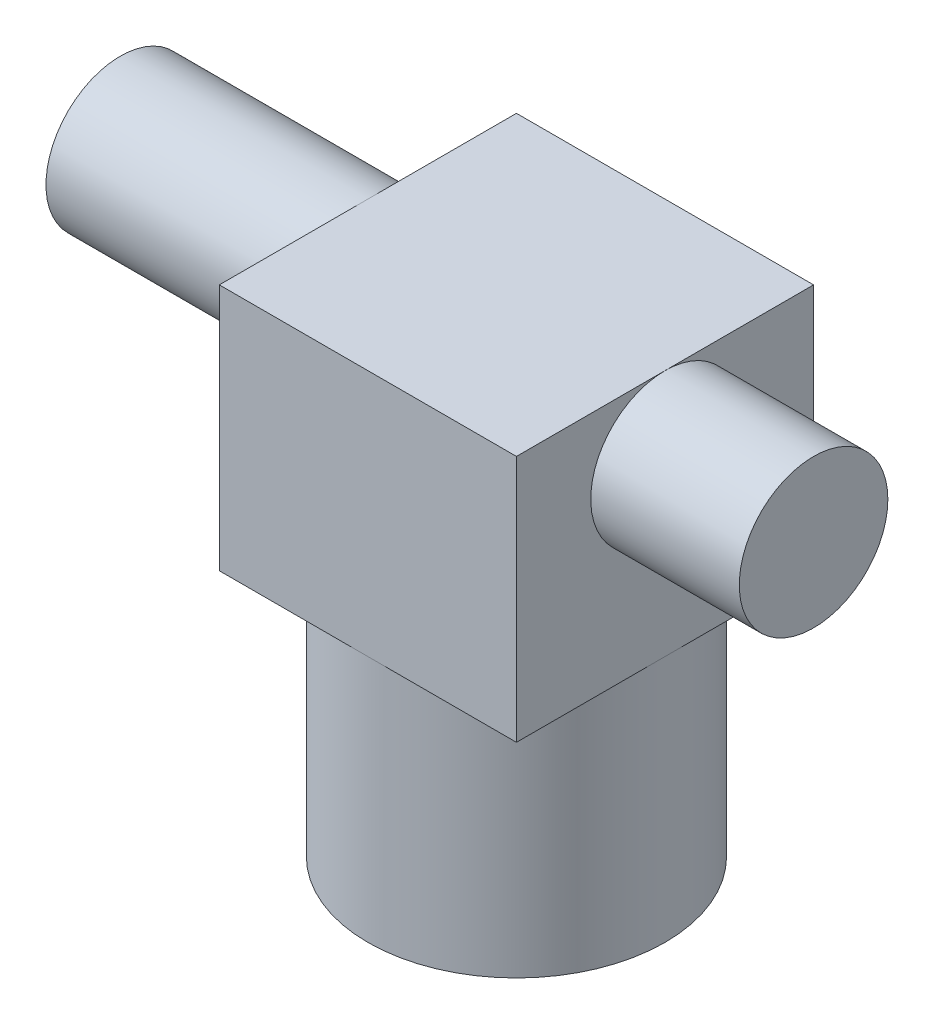
ISO-10303-21;
HEADER;
FILE_DESCRIPTION(('STEP AP214'),'2;1');
FILE_NAME('part.step','',(''),(''),'','','');
FILE_SCHEMA(('AUTOMOTIVE_DESIGN { 1 0 10303 214 1 1 1 1 }'));
ENDSEC;
DATA;
#1=APPLICATION_CONTEXT('core data for automotive mechanical design processes');
#2=APPLICATION_PROTOCOL_DEFINITION('international standard','automotive_design',2000,#1);
#3=PRODUCT_CONTEXT('',#1,'mechanical');
#4=PRODUCT('Part','Part','',(#3));
#5=PRODUCT_RELATED_PRODUCT_CATEGORY('part','',(#4));
#6=PRODUCT_DEFINITION_FORMATION('','',#4);
#7=PRODUCT_DEFINITION_CONTEXT('part definition',#1,'design');
#8=PRODUCT_DEFINITION('design','',#6,#7);
#9=PRODUCT_DEFINITION_SHAPE('','',#8);
#10=(LENGTH_UNIT() NAMED_UNIT(*) SI_UNIT(.MILLI.,.METRE.));
#11=(NAMED_UNIT(*) PLANE_ANGLE_UNIT() SI_UNIT($,.RADIAN.));
#12=(NAMED_UNIT(*) SI_UNIT($,.STERADIAN.) SOLID_ANGLE_UNIT());
#13=UNCERTAINTY_MEASURE_WITH_UNIT(LENGTH_MEASURE(1.E-05),#10,'distance_accuracy_value','');
#14=(GEOMETRIC_REPRESENTATION_CONTEXT(3) GLOBAL_UNCERTAINTY_ASSIGNED_CONTEXT((#13)) GLOBAL_UNIT_ASSIGNED_CONTEXT((#10,
#11,#12)) REPRESENTATION_CONTEXT('',''));
#15=CARTESIAN_POINT('',(0.,0.,0.));
#16=DIRECTION('',(0.,0.,1.));
#17=DIRECTION('',(1.,0.,0.));
#18=AXIS2_PLACEMENT_3D('',#15,#16,#17);
#19=CARTESIAN_POINT('',(0.,-31.75,0.));
#20=DIRECTION('',(0.,1.,0.));
#21=DIRECTION('',(0.,0.,1.));
#22=AXIS2_PLACEMENT_3D('',#19,#20,#21);
#23=CYLINDRICAL_SURFACE('',#22,19.05);
#24=CARTESIAN_POINT('',(0.,0.,0.));
#25=DIRECTION('',(0.,-1.,0.));
#26=DIRECTION('',(0.,0.,1.));
#27=AXIS2_PLACEMENT_3D('',#24,#25,#26);
#28=CIRCLE('',#27,19.05);
#29=CARTESIAN_POINT('',(19.05,0.,0.));
#30=VERTEX_POINT('',#29);
#31=CARTESIAN_POINT('',(0.,0.,19.05));
#32=VERTEX_POINT('',#31);
#33=EDGE_CURVE('E104',#30,#32,#28,.T.);
#34=ORIENTED_EDGE('',*,*,#33,.T.);
#35=CARTESIAN_POINT('',(0.,0.,0.));
#36=DIRECTION('',(0.,-1.,0.));
#37=DIRECTION('',(0.,0.,1.));
#38=AXIS2_PLACEMENT_3D('',#35,#36,#37);
#39=CIRCLE('',#38,19.05);
#40=CARTESIAN_POINT('',(-19.05,0.,0.));
#41=VERTEX_POINT('',#40);
#42=EDGE_CURVE('E157',#32,#41,#39,.T.);
#43=ORIENTED_EDGE('',*,*,#42,.T.);
#44=CARTESIAN_POINT('',(0.,0.,0.));
#45=DIRECTION('',(0.,-1.,0.));
#46=DIRECTION('',(0.,0.,1.));
#47=AXIS2_PLACEMENT_3D('',#44,#45,#46);
#48=CIRCLE('',#47,19.05);
#49=CARTESIAN_POINT('',(0.,0.,-19.05));
#50=VERTEX_POINT('',#49);
#51=EDGE_CURVE('E119',#41,#50,#48,.T.);
#52=ORIENTED_EDGE('',*,*,#51,.T.);
#53=CARTESIAN_POINT('',(0.,0.,0.));
#54=DIRECTION('',(0.,-1.,0.));
#55=DIRECTION('',(0.,0.,1.));
#56=AXIS2_PLACEMENT_3D('',#53,#54,#55);
#57=CIRCLE('',#56,19.05);
#58=EDGE_CURVE('E26',#50,#30,#57,.T.);
#59=ORIENTED_EDGE('',*,*,#58,.T.);
#60=EDGE_LOOP('',(#34,#43,#52,#59));
#61=FACE_BOUND('',#60,.T.);
#62=CARTESIAN_POINT('',(0.,-31.75,0.));
#63=DIRECTION('',(0.,1.,0.));
#64=DIRECTION('',(0.,0.,1.));
#65=AXIS2_PLACEMENT_3D('',#62,#63,#64);
#66=CIRCLE('',#65,19.05);
#67=CARTESIAN_POINT('',(0.,-31.75,19.05));
#68=VERTEX_POINT('',#67);
#69=EDGE_CURVE('E11',#68,#68,#66,.T.);
#70=ORIENTED_EDGE('',*,*,#69,.T.);
#71=EDGE_LOOP('',(#70));
#72=FACE_BOUND('',#71,.T.);
#73=ADVANCED_FACE('F16',(#61,#72),#23,.T.);
#74=CARTESIAN_POINT('',(-50.8,22.225,0.));
#75=DIRECTION('',(1.,0.,0.));
#76=DIRECTION('',(0.,0.,-1.));
#77=AXIS2_PLACEMENT_3D('',#74,#75,#76);
#78=CYLINDRICAL_SURFACE('',#77,9.525);
#79=CARTESIAN_POINT('',(-19.05,22.225,0.));
#80=DIRECTION('',(1.,0.,0.));
#81=DIRECTION('',(0.,0.,-1.));
#82=AXIS2_PLACEMENT_3D('',#79,#80,#81);
#83=CIRCLE('',#82,9.525);
#84=CARTESIAN_POINT('',(-19.05,31.75,0.));
#85=VERTEX_POINT('',#84);
#86=EDGE_CURVE('E115',#85,#85,#83,.T.);
#87=ORIENTED_EDGE('',*,*,#86,.F.);
#88=EDGE_LOOP('',(#87));
#89=FACE_BOUND('',#88,.T.);
#90=CARTESIAN_POINT('',(-50.8,22.225,0.));
#91=DIRECTION('',(1.,0.,0.));
#92=DIRECTION('',(0.,0.,-1.));
#93=AXIS2_PLACEMENT_3D('',#90,#91,#92);
#94=CIRCLE('',#93,9.525);
#95=CARTESIAN_POINT('',(-50.8,22.225,-9.525));
#96=VERTEX_POINT('',#95);
#97=EDGE_CURVE('E150',#96,#96,#94,.T.);
#98=ORIENTED_EDGE('',*,*,#97,.T.);
#99=EDGE_LOOP('',(#98));
#100=FACE_BOUND('',#99,.T.);
#101=ADVANCED_FACE('F169',(#89,#100),#78,.T.);
#102=CARTESIAN_POINT('',(-50.8,22.225,0.));
#103=DIRECTION('',(1.,0.,0.));
#104=DIRECTION('',(0.,0.,-1.));
#105=AXIS2_PLACEMENT_3D('',#102,#103,#104);
#106=CYLINDRICAL_SURFACE('',#105,9.525);
#107=CARTESIAN_POINT('',(38.1,22.225,0.));
#108=DIRECTION('',(-1.,0.,0.));
#109=DIRECTION('',(0.,0.,-1.));
#110=AXIS2_PLACEMENT_3D('',#107,#108,#109);
#111=CIRCLE('',#110,9.525);
#112=CARTESIAN_POINT('',(38.1,22.225,-9.525));
#113=VERTEX_POINT('',#112);
#114=EDGE_CURVE('E114',#113,#113,#111,.T.);
#115=ORIENTED_EDGE('',*,*,#114,.T.);
#116=EDGE_LOOP('',(#115));
#117=FACE_BOUND('',#116,.T.);
#118=CARTESIAN_POINT('',(19.05,22.225,0.));
#119=DIRECTION('',(1.,0.,0.));
#120=DIRECTION('',(0.,0.,-1.));
#121=AXIS2_PLACEMENT_3D('',#118,#119,#120);
#122=CIRCLE('',#121,9.525);
#123=CARTESIAN_POINT('',(19.05,31.75,0.));
#124=VERTEX_POINT('',#123);
#125=EDGE_CURVE('E155',#124,#124,#122,.T.);
#126=ORIENTED_EDGE('',*,*,#125,.T.);
#127=EDGE_LOOP('',(#126));
#128=FACE_BOUND('',#127,.T.);
#129=ADVANCED_FACE('F167',(#117,#128),#106,.T.);
#130=CARTESIAN_POINT('',(-19.05,31.75,19.05));
#131=DIRECTION('',(1.,0.,0.));
#132=DIRECTION('',(0.,0.,-1.));
#133=AXIS2_PLACEMENT_3D('',#130,#131,#132);
#134=PLANE('',#133);
#135=DIRECTION('',(0.,8.74890638209662E-09,1.));
#136=VECTOR('',#135,1.);
#137=CARTESIAN_POINT('',(-19.05,31.7499999166667,-9.52500000000001));
#138=LINE('',#137,#136);
#139=CARTESIAN_POINT('',(-19.05,31.7499998333333,-19.05));
#140=VERTEX_POINT('',#139);
#141=EDGE_CURVE('E116',#140,#85,#138,.T.);
#142=ORIENTED_EDGE('',*,*,#141,.F.);
#143=DIRECTION('',(0.,1.,-5.24934385681359E-09));
#144=VECTOR('',#143,1.);
#145=CARTESIAN_POINT('',(-19.05,15.8749999166667,-19.0499999166667));
#146=LINE('',#145,#144);
#147=CARTESIAN_POINT('',(-19.05,0.,-19.0499998333333));
#148=VERTEX_POINT('',#147);
#149=EDGE_CURVE('E123',#148,#140,#146,.T.);
#150=ORIENTED_EDGE('',*,*,#149,.F.);
#151=DIRECTION('',(0.,0.,-1.));
#152=VECTOR('',#151,1.);
#153=CARTESIAN_POINT('',(-19.05,0.,-9.52499991666667));
#154=LINE('',#153,#152);
#155=EDGE_CURVE('E20',#41,#148,#154,.T.);
#156=ORIENTED_EDGE('',*,*,#155,.F.);
#157=DIRECTION('',(0.,0.,-1.));
#158=VECTOR('',#157,1.);
#159=CARTESIAN_POINT('',(-19.05,0.,9.525));
#160=LINE('',#159,#158);
#161=CARTESIAN_POINT('',(-19.05,0.,19.05));
#162=VERTEX_POINT('',#161);
#163=EDGE_CURVE('E125',#162,#41,#160,.T.);
#164=ORIENTED_EDGE('',*,*,#163,.F.);
#165=DIRECTION('',(0.,1.,-5.24934382925797E-09));
#166=VECTOR('',#165,1.);
#167=CARTESIAN_POINT('',(-19.05,15.875,19.0499999166667));
#168=LINE('',#167,#166);
#169=CARTESIAN_POINT('',(-19.05,31.75,19.0499998333333));
#170=VERTEX_POINT('',#169);
#171=EDGE_CURVE('E111',#162,#170,#168,.T.);
#172=ORIENTED_EDGE('',*,*,#171,.T.);
#173=DIRECTION('',(0.,0.,1.));
#174=VECTOR('',#173,1.);
#175=CARTESIAN_POINT('',(-19.05,31.75,9.52499991666667));
#176=LINE('',#175,#174);
#177=EDGE_CURVE('E120',#85,#170,#176,.T.);
#178=ORIENTED_EDGE('',*,*,#177,.F.);
#179=ORIENTED_EDGE('',*,*,#86,.T.);
#180=EDGE_LOOP('',(#142,#150,#156,#164,#172,#178,#179));
#181=FACE_BOUND('',#180,.T.);
#182=ADVANCED_FACE('F133',(#181),#134,.F.);
#183=CARTESIAN_POINT('',(-42.0514213562373,-31.75,0.));
#184=DIRECTION('',(0.,1.,0.));
#185=DIRECTION('',(0.,0.,1.));
#186=AXIS2_PLACEMENT_3D('',#183,#184,#185);
#187=PLANE('',#186);
#188=ORIENTED_EDGE('',*,*,#69,.F.);
#189=EDGE_LOOP('',(#188));
#190=FACE_BOUND('',#189,.T.);
#191=ADVANCED_FACE('F177',(#190),#187,.F.);
#192=CARTESIAN_POINT('',(-19.05,31.75,-19.05));
#193=DIRECTION('',(0.,1.,0.));
#194=DIRECTION('',(0.,0.,1.));
#195=AXIS2_PLACEMENT_3D('',#192,#193,#194);
#196=PLANE('',#195);
#197=ORIENTED_EDGE('',*,*,#141,.T.);
#198=ORIENTED_EDGE('',*,*,#177,.T.);
#199=DIRECTION('',(1.,0.,0.));
#200=VECTOR('',#199,1.);
#201=CARTESIAN_POINT('',(19.05,31.75,19.05));
#202=LINE('',#201,#200);
#203=CARTESIAN_POINT('',(19.05,31.75,19.05));
#204=VERTEX_POINT('',#203);
#205=EDGE_CURVE('E122',#170,#204,#202,.T.);
#206=ORIENTED_EDGE('',*,*,#205,.T.);
#207=DIRECTION('',(0.,0.,-1.));
#208=VECTOR('',#207,1.);
#209=CARTESIAN_POINT('',(19.05,31.75,-19.05));
#210=LINE('',#209,#208);
#211=EDGE_CURVE('E87',#204,#124,#210,.T.);
#212=ORIENTED_EDGE('',*,*,#211,.T.);
#213=DIRECTION('',(0.,0.,-1.));
#214=VECTOR('',#213,1.);
#215=CARTESIAN_POINT('',(19.05,31.75,-19.05));
#216=LINE('',#215,#214);
#217=CARTESIAN_POINT('',(19.05,31.75,-19.05));
#218=VERTEX_POINT('',#217);
#219=EDGE_CURVE('E139',#124,#218,#216,.T.);
#220=ORIENTED_EDGE('',*,*,#219,.T.);
#221=DIRECTION('',(-1.,0.,0.));
#222=VECTOR('',#221,1.);
#223=CARTESIAN_POINT('',(19.05,31.75,-19.05));
#224=LINE('',#223,#222);
#225=EDGE_CURVE('E137',#218,#140,#224,.T.);
#226=ORIENTED_EDGE('',*,*,#225,.T.);
#227=EDGE_LOOP('',(#197,#198,#206,#212,#220,#226));
#228=FACE_BOUND('',#227,.T.);
#229=ADVANCED_FACE('F165',(#228),#196,.T.);
#230=CARTESIAN_POINT('',(19.05,31.75,-19.05));
#231=DIRECTION('',(0.,0.,1.));
#232=DIRECTION('',(1.,0.,0.));
#233=AXIS2_PLACEMENT_3D('',#230,#231,#232);
#234=PLANE('',#233);
#235=DIRECTION('',(-1.,0.,0.));
#236=VECTOR('',#235,1.);
#237=CARTESIAN_POINT('',(-19.05,0.,-19.05));
#238=LINE('',#237,#236);
#239=EDGE_CURVE('E35',#50,#148,#238,.T.);
#240=ORIENTED_EDGE('',*,*,#239,.T.);
#241=ORIENTED_EDGE('',*,*,#149,.T.);
#242=ORIENTED_EDGE('',*,*,#225,.F.);
#243=DIRECTION('',(0.,-1.,0.));
#244=VECTOR('',#243,1.);
#245=CARTESIAN_POINT('',(19.05,31.75,-19.05));
#246=LINE('',#245,#244);
#247=CARTESIAN_POINT('',(19.05,0.,-19.05));
#248=VERTEX_POINT('',#247);
#249=EDGE_CURVE('E124',#218,#248,#246,.T.);
#250=ORIENTED_EDGE('',*,*,#249,.T.);
#251=DIRECTION('',(-1.,0.,0.));
#252=VECTOR('',#251,1.);
#253=CARTESIAN_POINT('',(-19.05,0.,-19.05));
#254=LINE('',#253,#252);
#255=EDGE_CURVE('E73',#248,#50,#254,.T.);
#256=ORIENTED_EDGE('',*,*,#255,.T.);
#257=EDGE_LOOP('',(#240,#241,#242,#250,#256));
#258=FACE_BOUND('',#257,.T.);
#259=ADVANCED_FACE('F136',(#258),#234,.F.);
#260=CARTESIAN_POINT('',(19.05,31.75,19.05));
#261=DIRECTION('',(0.,0.,-1.));
#262=DIRECTION('',(-1.,0.,0.));
#263=AXIS2_PLACEMENT_3D('',#260,#261,#262);
#264=PLANE('',#263);
#265=DIRECTION('',(1.,0.,0.));
#266=VECTOR('',#265,1.);
#267=CARTESIAN_POINT('',(-19.05,0.,19.05));
#268=LINE('',#267,#266);
#269=CARTESIAN_POINT('',(19.05,0.,19.05));
#270=VERTEX_POINT('',#269);
#271=EDGE_CURVE('E93',#32,#270,#268,.T.);
#272=ORIENTED_EDGE('',*,*,#271,.T.);
#273=DIRECTION('',(0.,-1.,0.));
#274=VECTOR('',#273,1.);
#275=CARTESIAN_POINT('',(19.05,31.75,19.05));
#276=LINE('',#275,#274);
#277=EDGE_CURVE('E79',#204,#270,#276,.T.);
#278=ORIENTED_EDGE('',*,*,#277,.F.);
#279=ORIENTED_EDGE('',*,*,#205,.F.);
#280=ORIENTED_EDGE('',*,*,#171,.F.);
#281=DIRECTION('',(1.,0.,0.));
#282=VECTOR('',#281,1.);
#283=CARTESIAN_POINT('',(-19.05,0.,19.05));
#284=LINE('',#283,#282);
#285=EDGE_CURVE('E97',#162,#32,#284,.T.);
#286=ORIENTED_EDGE('',*,*,#285,.T.);
#287=EDGE_LOOP('',(#272,#278,#279,#280,#286));
#288=FACE_BOUND('',#287,.T.);
#289=ADVANCED_FACE('F94',(#288),#264,.F.);
#290=CARTESIAN_POINT('',(-19.05,0.,-19.05));
#291=DIRECTION('',(0.,1.,0.));
#292=DIRECTION('',(0.,0.,1.));
#293=AXIS2_PLACEMENT_3D('',#290,#291,#292);
#294=PLANE('',#293);
#295=ORIENTED_EDGE('',*,*,#42,.F.);
#296=ORIENTED_EDGE('',*,*,#285,.F.);
#297=ORIENTED_EDGE('',*,*,#163,.T.);
#298=EDGE_LOOP('',(#295,#296,#297));
#299=FACE_BOUND('',#298,.T.);
#300=ADVANCED_FACE('F199',(#299),#294,.F.);
#301=CARTESIAN_POINT('',(-19.05,0.,-19.05));
#302=DIRECTION('',(0.,1.,0.));
#303=DIRECTION('',(0.,0.,1.));
#304=AXIS2_PLACEMENT_3D('',#301,#302,#303);
#305=PLANE('',#304);
#306=ORIENTED_EDGE('',*,*,#51,.F.);
#307=ORIENTED_EDGE('',*,*,#155,.T.);
#308=ORIENTED_EDGE('',*,*,#239,.F.);
#309=EDGE_LOOP('',(#306,#307,#308));
#310=FACE_BOUND('',#309,.T.);
#311=ADVANCED_FACE('F130',(#310),#305,.F.);
#312=CARTESIAN_POINT('',(-19.05,0.,-19.05));
#313=DIRECTION('',(0.,1.,0.));
#314=DIRECTION('',(0.,0.,1.));
#315=AXIS2_PLACEMENT_3D('',#312,#313,#314);
#316=PLANE('',#315);
#317=ORIENTED_EDGE('',*,*,#58,.F.);
#318=ORIENTED_EDGE('',*,*,#255,.F.);
#319=DIRECTION('',(0.,0.,-1.));
#320=VECTOR('',#319,1.);
#321=CARTESIAN_POINT('',(19.05,0.,19.05));
#322=LINE('',#321,#320);
#323=EDGE_CURVE('E106',#30,#248,#322,.T.);
#324=ORIENTED_EDGE('',*,*,#323,.F.);
#325=EDGE_LOOP('',(#317,#318,#324));
#326=FACE_BOUND('',#325,.T.);
#327=ADVANCED_FACE('F147',(#326),#316,.F.);
#328=CARTESIAN_POINT('',(-19.05,0.,-19.05));
#329=DIRECTION('',(0.,1.,0.));
#330=DIRECTION('',(0.,0.,1.));
#331=AXIS2_PLACEMENT_3D('',#328,#329,#330);
#332=PLANE('',#331);
#333=ORIENTED_EDGE('',*,*,#33,.F.);
#334=DIRECTION('',(0.,0.,-1.));
#335=VECTOR('',#334,1.);
#336=CARTESIAN_POINT('',(19.05,0.,19.05));
#337=LINE('',#336,#335);
#338=EDGE_CURVE('E84',#270,#30,#337,.T.);
#339=ORIENTED_EDGE('',*,*,#338,.F.);
#340=ORIENTED_EDGE('',*,*,#271,.F.);
#341=EDGE_LOOP('',(#333,#339,#340));
#342=FACE_BOUND('',#341,.T.);
#343=ADVANCED_FACE('F102',(#342),#332,.F.);
#344=CARTESIAN_POINT('',(-50.8,22.225,0.));
#345=DIRECTION('',(1.,0.,0.));
#346=DIRECTION('',(0.,0.,-1.));
#347=AXIS2_PLACEMENT_3D('',#344,#345,#346);
#348=PLANE('',#347);
#349=ORIENTED_EDGE('',*,*,#97,.F.);
#350=EDGE_LOOP('',(#349));
#351=FACE_BOUND('',#350,.T.);
#352=ADVANCED_FACE('F208',(#351),#348,.F.);
#353=CARTESIAN_POINT('',(19.05,31.75,19.05));
#354=DIRECTION('',(-1.,0.,0.));
#355=DIRECTION('',(0.,0.,1.));
#356=AXIS2_PLACEMENT_3D('',#353,#354,#355);
#357=PLANE('',#356);
#358=ORIENTED_EDGE('',*,*,#211,.F.);
#359=ORIENTED_EDGE('',*,*,#277,.T.);
#360=ORIENTED_EDGE('',*,*,#338,.T.);
#361=ORIENTED_EDGE('',*,*,#323,.T.);
#362=ORIENTED_EDGE('',*,*,#249,.F.);
#363=ORIENTED_EDGE('',*,*,#219,.F.);
#364=ORIENTED_EDGE('',*,*,#125,.F.);
#365=EDGE_LOOP('',(#358,#359,#360,#361,#362,#363,#364));
#366=FACE_BOUND('',#365,.T.);
#367=ADVANCED_FACE('F81',(#366),#357,.F.);
#368=CARTESIAN_POINT('',(38.1,22.225,0.));
#369=DIRECTION('',(1.,0.,0.));
#370=DIRECTION('',(0.,0.,-1.));
#371=AXIS2_PLACEMENT_3D('',#368,#369,#370);
#372=PLANE('',#371);
#373=ORIENTED_EDGE('',*,*,#114,.F.);
#374=EDGE_LOOP('',(#373));
#375=FACE_BOUND('',#374,.T.);
#376=ADVANCED_FACE('F18',(#375),#372,.T.);
#377=CLOSED_SHELL('',(#73,#101,#129,#182,#191,#229,#259,#289,#300,#311,#327,#343,#352,#367,#376));
#378=MANIFOLD_SOLID_BREP('B1',#377);
#379=ADVANCED_BREP_SHAPE_REPRESENTATION('',(#18,#378),#14);
#380=SHAPE_DEFINITION_REPRESENTATION(#9,#379);
ENDSEC;
END-ISO-10303-21;
